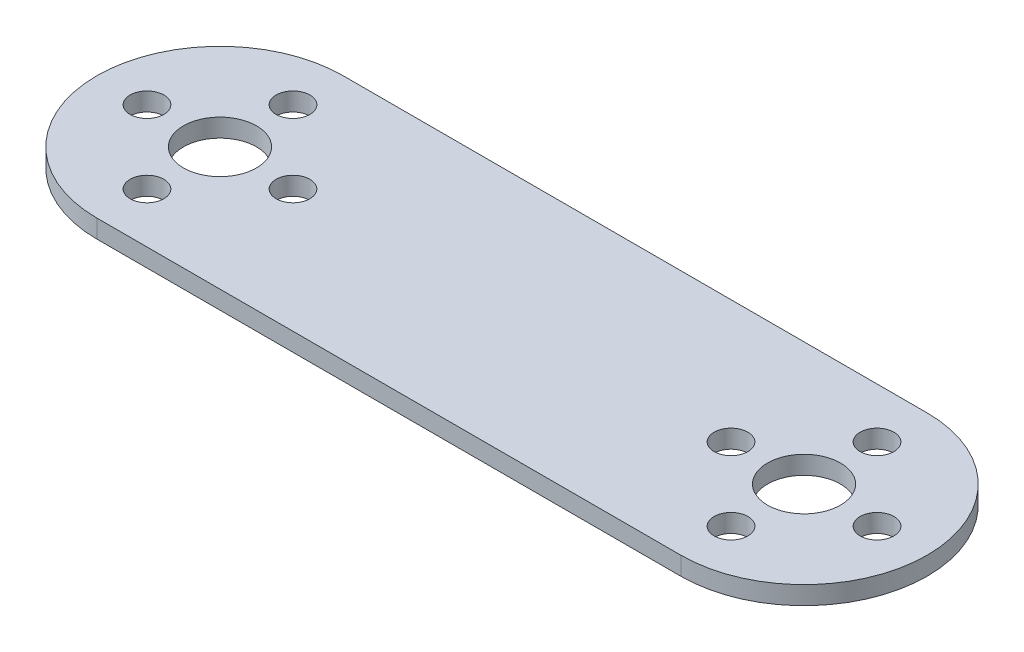
ISO-10303-21;
HEADER;
FILE_DESCRIPTION(('STEP AP214'),'2;1');
FILE_NAME('part.step','',(''),(''),'','','');
FILE_SCHEMA(('AUTOMOTIVE_DESIGN { 1 0 10303 214 1 1 1 1 }'));
ENDSEC;
DATA;
#1=APPLICATION_CONTEXT('core data for automotive mechanical design processes');
#2=APPLICATION_PROTOCOL_DEFINITION('international standard','automotive_design',2000,#1);
#3=PRODUCT_CONTEXT('',#1,'mechanical');
#4=PRODUCT('Part','Part','',(#3));
#5=PRODUCT_RELATED_PRODUCT_CATEGORY('part','',(#4));
#6=PRODUCT_DEFINITION_FORMATION('','',#4);
#7=PRODUCT_DEFINITION_CONTEXT('part definition',#1,'design');
#8=PRODUCT_DEFINITION('design','',#6,#7);
#9=PRODUCT_DEFINITION_SHAPE('','',#8);
#10=(LENGTH_UNIT() NAMED_UNIT(*) SI_UNIT(.MILLI.,.METRE.));
#11=(NAMED_UNIT(*) PLANE_ANGLE_UNIT() SI_UNIT($,.RADIAN.));
#12=(NAMED_UNIT(*) SI_UNIT($,.STERADIAN.) SOLID_ANGLE_UNIT());
#13=UNCERTAINTY_MEASURE_WITH_UNIT(LENGTH_MEASURE(1.E-05),#10,'distance_accuracy_value','');
#14=(GEOMETRIC_REPRESENTATION_CONTEXT(3) GLOBAL_UNCERTAINTY_ASSIGNED_CONTEXT((#13)) GLOBAL_UNIT_ASSIGNED_CONTEXT((#10,
#11,#12)) REPRESENTATION_CONTEXT('',''));
#15=CARTESIAN_POINT('',(0.,0.,0.));
#16=DIRECTION('',(0.,0.,1.));
#17=DIRECTION('',(1.,0.,0.));
#18=AXIS2_PLACEMENT_3D('',#15,#16,#17);
#19=CARTESIAN_POINT('',(0.,2.,0.));
#20=DIRECTION('',(0.,1.,0.));
#21=DIRECTION('',(0.,0.,1.));
#22=AXIS2_PLACEMENT_3D('',#19,#20,#21);
#23=PLANE('',#22);
#24=CARTESIAN_POINT('',(56.,2.,0.));
#25=DIRECTION('',(0.,1.,0.));
#26=DIRECTION('',(0.,0.,1.));
#27=AXIS2_PLACEMENT_3D('',#24,#25,#26);
#28=CIRCLE('',#27,1.85);
#29=CARTESIAN_POINT('',(56.,2.,1.85));
#30=VERTEX_POINT('',#29);
#31=EDGE_CURVE('E112',#30,#30,#28,.F.);
#32=ORIENTED_EDGE('',*,*,#31,.T.);
#33=EDGE_LOOP('',(#32));
#34=FACE_BOUND('',#33,.T.);
#35=CARTESIAN_POINT('',(64.,2.,8.));
#36=DIRECTION('',(0.,1.,0.));
#37=DIRECTION('',(0.,0.,1.));
#38=AXIS2_PLACEMENT_3D('',#35,#36,#37);
#39=CIRCLE('',#38,1.85);
#40=CARTESIAN_POINT('',(64.,2.,9.85));
#41=VERTEX_POINT('',#40);
#42=EDGE_CURVE('E115',#41,#41,#39,.F.);
#43=ORIENTED_EDGE('',*,*,#42,.T.);
#44=EDGE_LOOP('',(#43));
#45=FACE_BOUND('',#44,.T.);
#46=CARTESIAN_POINT('',(72.,2.,0.));
#47=DIRECTION('',(0.,1.,0.));
#48=DIRECTION('',(0.,0.,1.));
#49=AXIS2_PLACEMENT_3D('',#46,#47,#48);
#50=CIRCLE('',#49,1.85);
#51=CARTESIAN_POINT('',(72.,2.,1.85));
#52=VERTEX_POINT('',#51);
#53=EDGE_CURVE('E118',#52,#52,#50,.F.);
#54=ORIENTED_EDGE('',*,*,#53,.T.);
#55=EDGE_LOOP('',(#54));
#56=FACE_BOUND('',#55,.T.);
#57=CARTESIAN_POINT('',(64.,2.,-8.));
#58=DIRECTION('',(0.,1.,0.));
#59=DIRECTION('',(0.,0.,1.));
#60=AXIS2_PLACEMENT_3D('',#57,#58,#59);
#61=CIRCLE('',#60,1.85);
#62=CARTESIAN_POINT('',(64.,2.,-6.15));
#63=VERTEX_POINT('',#62);
#64=EDGE_CURVE('E121',#63,#63,#61,.F.);
#65=ORIENTED_EDGE('',*,*,#64,.T.);
#66=EDGE_LOOP('',(#65));
#67=FACE_BOUND('',#66,.T.);
#68=CARTESIAN_POINT('',(64.,2.,0.));
#69=DIRECTION('',(0.,1.,0.));
#70=DIRECTION('',(0.,0.,1.));
#71=AXIS2_PLACEMENT_3D('',#68,#69,#70);
#72=CIRCLE('',#71,4.);
#73=CARTESIAN_POINT('',(64.,2.,4.));
#74=VERTEX_POINT('',#73);
#75=EDGE_CURVE('E124',#74,#74,#72,.F.);
#76=ORIENTED_EDGE('',*,*,#75,.T.);
#77=EDGE_LOOP('',(#76));
#78=FACE_BOUND('',#77,.T.);
#79=CARTESIAN_POINT('',(-8.,2.,0.));
#80=DIRECTION('',(0.,1.,0.));
#81=DIRECTION('',(0.,0.,1.));
#82=AXIS2_PLACEMENT_3D('',#79,#80,#81);
#83=CIRCLE('',#82,1.85);
#84=CARTESIAN_POINT('',(-8.,2.,1.85));
#85=VERTEX_POINT('',#84);
#86=EDGE_CURVE('E127',#85,#85,#83,.F.);
#87=ORIENTED_EDGE('',*,*,#86,.T.);
#88=EDGE_LOOP('',(#87));
#89=FACE_BOUND('',#88,.T.);
#90=CARTESIAN_POINT('',(0.,2.,8.));
#91=DIRECTION('',(0.,1.,0.));
#92=DIRECTION('',(0.,0.,1.));
#93=AXIS2_PLACEMENT_3D('',#90,#91,#92);
#94=CIRCLE('',#93,1.85);
#95=CARTESIAN_POINT('',(0.,2.,9.85));
#96=VERTEX_POINT('',#95);
#97=EDGE_CURVE('E130',#96,#96,#94,.F.);
#98=ORIENTED_EDGE('',*,*,#97,.T.);
#99=EDGE_LOOP('',(#98));
#100=FACE_BOUND('',#99,.T.);
#101=CARTESIAN_POINT('',(8.,2.,0.));
#102=DIRECTION('',(0.,1.,0.));
#103=DIRECTION('',(0.,0.,1.));
#104=AXIS2_PLACEMENT_3D('',#101,#102,#103);
#105=CIRCLE('',#104,1.85);
#106=CARTESIAN_POINT('',(8.,2.,1.85));
#107=VERTEX_POINT('',#106);
#108=EDGE_CURVE('E133',#107,#107,#105,.F.);
#109=ORIENTED_EDGE('',*,*,#108,.T.);
#110=EDGE_LOOP('',(#109));
#111=FACE_BOUND('',#110,.T.);
#112=CARTESIAN_POINT('',(0.,2.,-8.));
#113=DIRECTION('',(0.,1.,0.));
#114=DIRECTION('',(0.,0.,1.));
#115=AXIS2_PLACEMENT_3D('',#112,#113,#114);
#116=CIRCLE('',#115,1.85);
#117=CARTESIAN_POINT('',(0.,2.,-6.15));
#118=VERTEX_POINT('',#117);
#119=EDGE_CURVE('E136',#118,#118,#116,.F.);
#120=ORIENTED_EDGE('',*,*,#119,.T.);
#121=EDGE_LOOP('',(#120));
#122=FACE_BOUND('',#121,.T.);
#123=CARTESIAN_POINT('',(0.,2.,0.));
#124=DIRECTION('',(0.,1.,0.));
#125=DIRECTION('',(0.,0.,1.));
#126=AXIS2_PLACEMENT_3D('',#123,#124,#125);
#127=CIRCLE('',#126,4.);
#128=CARTESIAN_POINT('',(0.,2.,4.));
#129=VERTEX_POINT('',#128);
#130=EDGE_CURVE('E139',#129,#129,#127,.F.);
#131=ORIENTED_EDGE('',*,*,#130,.T.);
#132=EDGE_LOOP('',(#131));
#133=FACE_BOUND('',#132,.T.);
#134=DIRECTION('',(-1.,0.,0.));
#135=VECTOR('',#134,1.);
#136=CARTESIAN_POINT('',(64.,2.,-13.5));
#137=LINE('',#136,#135);
#138=CARTESIAN_POINT('',(0.,2.,-13.5));
#139=VERTEX_POINT('',#138);
#140=CARTESIAN_POINT('',(64.,2.,-13.5));
#141=VERTEX_POINT('',#140);
#142=EDGE_CURVE('E66',#139,#141,#137,.F.);
#143=ORIENTED_EDGE('',*,*,#142,.F.);
#144=CARTESIAN_POINT('',(0.,2.,0.));
#145=DIRECTION('',(0.,1.,0.));
#146=DIRECTION('',(0.,0.,1.));
#147=AXIS2_PLACEMENT_3D('',#144,#145,#146);
#148=CIRCLE('',#147,13.5);
#149=CARTESIAN_POINT('',(0.,2.,13.5));
#150=VERTEX_POINT('',#149);
#151=EDGE_CURVE('E18',#150,#139,#148,.F.);
#152=ORIENTED_EDGE('',*,*,#151,.F.);
#153=DIRECTION('',(1.,0.,0.));
#154=VECTOR('',#153,1.);
#155=CARTESIAN_POINT('',(0.,2.,13.5));
#156=LINE('',#155,#154);
#157=CARTESIAN_POINT('',(64.,2.,13.5));
#158=VERTEX_POINT('',#157);
#159=EDGE_CURVE('E53',#158,#150,#156,.F.);
#160=ORIENTED_EDGE('',*,*,#159,.F.);
#161=CARTESIAN_POINT('',(64.,2.,0.));
#162=DIRECTION('',(0.,1.,0.));
#163=DIRECTION('',(0.,0.,1.));
#164=AXIS2_PLACEMENT_3D('',#161,#162,#163);
#165=CIRCLE('',#164,13.5);
#166=EDGE_CURVE('E73',#141,#158,#165,.F.);
#167=ORIENTED_EDGE('',*,*,#166,.F.);
#168=EDGE_LOOP('',(#143,#152,#160,#167));
#169=FACE_BOUND('',#168,.T.);
#170=ADVANCED_FACE('F15',(#34,#45,#56,#67,#78,#89,#100,#111,#122,#133,#169),#23,.T.);
#171=CARTESIAN_POINT('',(0.,0.,0.));
#172=DIRECTION('',(0.,1.,0.));
#173=DIRECTION('',(0.,0.,1.));
#174=AXIS2_PLACEMENT_3D('',#171,#172,#173);
#175=CYLINDRICAL_SURFACE('',#174,13.5);
#176=DIRECTION('',(0.,1.,0.));
#177=VECTOR('',#176,1.);
#178=CARTESIAN_POINT('',(0.,0.,-13.5));
#179=LINE('',#178,#177);
#180=CARTESIAN_POINT('',(0.,0.,-13.5));
#181=VERTEX_POINT('',#180);
#182=EDGE_CURVE('E78',#181,#139,#179,.T.);
#183=ORIENTED_EDGE('',*,*,#182,.F.);
#184=CARTESIAN_POINT('',(0.,0.,0.));
#185=DIRECTION('',(0.,1.,0.));
#186=DIRECTION('',(0.,0.,1.));
#187=AXIS2_PLACEMENT_3D('',#184,#185,#186);
#188=CIRCLE('',#187,13.5);
#189=CARTESIAN_POINT('',(0.,0.,13.5));
#190=VERTEX_POINT('',#189);
#191=EDGE_CURVE('E72',#181,#190,#188,.T.);
#192=ORIENTED_EDGE('',*,*,#191,.T.);
#193=DIRECTION('',(0.,1.,0.));
#194=VECTOR('',#193,1.);
#195=CARTESIAN_POINT('',(0.,0.,13.5));
#196=LINE('',#195,#194);
#197=EDGE_CURVE('E58',#150,#190,#196,.F.);
#198=ORIENTED_EDGE('',*,*,#197,.F.);
#199=ORIENTED_EDGE('',*,*,#151,.T.);
#200=EDGE_LOOP('',(#183,#192,#198,#199));
#201=FACE_BOUND('',#200,.T.);
#202=ADVANCED_FACE('F71',(#201),#175,.T.);
#203=CARTESIAN_POINT('',(0.,0.,13.5));
#204=DIRECTION('',(0.,0.,1.));
#205=DIRECTION('',(1.,0.,0.));
#206=AXIS2_PLACEMENT_3D('',#203,#204,#205);
#207=PLANE('',#206);
#208=ORIENTED_EDGE('',*,*,#197,.T.);
#209=DIRECTION('',(1.,0.,0.));
#210=VECTOR('',#209,1.);
#211=CARTESIAN_POINT('',(0.,0.,13.5));
#212=LINE('',#211,#210);
#213=CARTESIAN_POINT('',(64.,0.,13.5));
#214=VERTEX_POINT('',#213);
#215=EDGE_CURVE('E110',#190,#214,#212,.T.);
#216=ORIENTED_EDGE('',*,*,#215,.T.);
#217=DIRECTION('',(0.,1.,0.));
#218=VECTOR('',#217,1.);
#219=CARTESIAN_POINT('',(64.,0.,13.5));
#220=LINE('',#219,#218);
#221=EDGE_CURVE('E60',#158,#214,#220,.F.);
#222=ORIENTED_EDGE('',*,*,#221,.F.);
#223=ORIENTED_EDGE('',*,*,#159,.T.);
#224=EDGE_LOOP('',(#208,#216,#222,#223));
#225=FACE_BOUND('',#224,.T.);
#226=ADVANCED_FACE('F55',(#225),#207,.T.);
#227=CARTESIAN_POINT('',(64.,0.,0.));
#228=DIRECTION('',(0.,1.,0.));
#229=DIRECTION('',(0.,0.,1.));
#230=AXIS2_PLACEMENT_3D('',#227,#228,#229);
#231=CYLINDRICAL_SURFACE('',#230,13.5);
#232=ORIENTED_EDGE('',*,*,#221,.T.);
#233=CARTESIAN_POINT('',(64.,0.,0.));
#234=DIRECTION('',(0.,1.,0.));
#235=DIRECTION('',(0.,0.,1.));
#236=AXIS2_PLACEMENT_3D('',#233,#234,#235);
#237=CIRCLE('',#236,13.5);
#238=CARTESIAN_POINT('',(64.,0.,-13.5));
#239=VERTEX_POINT('',#238);
#240=EDGE_CURVE('E107',#214,#239,#237,.T.);
#241=ORIENTED_EDGE('',*,*,#240,.T.);
#242=DIRECTION('',(0.,1.,0.));
#243=VECTOR('',#242,1.);
#244=CARTESIAN_POINT('',(64.,0.,-13.5));
#245=LINE('',#244,#243);
#246=EDGE_CURVE('E33',#141,#239,#245,.F.);
#247=ORIENTED_EDGE('',*,*,#246,.F.);
#248=ORIENTED_EDGE('',*,*,#166,.T.);
#249=EDGE_LOOP('',(#232,#241,#247,#248));
#250=FACE_BOUND('',#249,.T.);
#251=ADVANCED_FACE('F148',(#250),#231,.T.);
#252=CARTESIAN_POINT('',(64.,0.,-13.5));
#253=DIRECTION('',(0.,0.,-1.));
#254=DIRECTION('',(-1.,0.,0.));
#255=AXIS2_PLACEMENT_3D('',#252,#253,#254);
#256=PLANE('',#255);
#257=ORIENTED_EDGE('',*,*,#246,.T.);
#258=DIRECTION('',(1.,0.,0.));
#259=VECTOR('',#258,1.);
#260=CARTESIAN_POINT('',(0.,0.,-13.5));
#261=LINE('',#260,#259);
#262=EDGE_CURVE('E106',#239,#181,#261,.F.);
#263=ORIENTED_EDGE('',*,*,#262,.T.);
#264=ORIENTED_EDGE('',*,*,#182,.T.);
#265=ORIENTED_EDGE('',*,*,#142,.T.);
#266=EDGE_LOOP('',(#257,#263,#264,#265));
#267=FACE_BOUND('',#266,.T.);
#268=ADVANCED_FACE('F151',(#267),#256,.T.);
#269=CARTESIAN_POINT('',(0.,0.,0.));
#270=DIRECTION('',(0.,1.,0.));
#271=DIRECTION('',(0.,0.,1.));
#272=AXIS2_PLACEMENT_3D('',#269,#270,#271);
#273=CYLINDRICAL_SURFACE('',#272,4.);
#274=CARTESIAN_POINT('',(0.,0.,0.));
#275=DIRECTION('',(0.,1.,0.));
#276=DIRECTION('',(0.,0.,1.));
#277=AXIS2_PLACEMENT_3D('',#274,#275,#276);
#278=CIRCLE('',#277,4.);
#279=CARTESIAN_POINT('',(0.,0.,4.));
#280=VERTEX_POINT('',#279);
#281=EDGE_CURVE('E103',#280,#280,#278,.F.);
#282=ORIENTED_EDGE('',*,*,#281,.T.);
#283=EDGE_LOOP('',(#282));
#284=FACE_BOUND('',#283,.T.);
#285=ORIENTED_EDGE('',*,*,#130,.F.);
#286=EDGE_LOOP('',(#285));
#287=FACE_BOUND('',#286,.T.);
#288=ADVANCED_FACE('F153',(#284,#287),#273,.F.);
#289=CARTESIAN_POINT('',(0.,0.,-8.));
#290=DIRECTION('',(0.,1.,0.));
#291=DIRECTION('',(0.,0.,1.));
#292=AXIS2_PLACEMENT_3D('',#289,#290,#291);
#293=CYLINDRICAL_SURFACE('',#292,1.85);
#294=CARTESIAN_POINT('',(0.,0.,-8.));
#295=DIRECTION('',(0.,1.,0.));
#296=DIRECTION('',(0.,0.,1.));
#297=AXIS2_PLACEMENT_3D('',#294,#295,#296);
#298=CIRCLE('',#297,1.85);
#299=CARTESIAN_POINT('',(0.,0.,-6.15));
#300=VERTEX_POINT('',#299);
#301=EDGE_CURVE('E100',#300,#300,#298,.F.);
#302=ORIENTED_EDGE('',*,*,#301,.T.);
#303=EDGE_LOOP('',(#302));
#304=FACE_BOUND('',#303,.T.);
#305=ORIENTED_EDGE('',*,*,#119,.F.);
#306=EDGE_LOOP('',(#305));
#307=FACE_BOUND('',#306,.T.);
#308=ADVANCED_FACE('F160',(#304,#307),#293,.F.);
#309=CARTESIAN_POINT('',(8.,0.,0.));
#310=DIRECTION('',(0.,1.,0.));
#311=DIRECTION('',(0.,0.,1.));
#312=AXIS2_PLACEMENT_3D('',#309,#310,#311);
#313=CYLINDRICAL_SURFACE('',#312,1.85);
#314=CARTESIAN_POINT('',(8.,0.,0.));
#315=DIRECTION('',(0.,1.,0.));
#316=DIRECTION('',(0.,0.,1.));
#317=AXIS2_PLACEMENT_3D('',#314,#315,#316);
#318=CIRCLE('',#317,1.85);
#319=CARTESIAN_POINT('',(8.,0.,1.85));
#320=VERTEX_POINT('',#319);
#321=EDGE_CURVE('E97',#320,#320,#318,.F.);
#322=ORIENTED_EDGE('',*,*,#321,.T.);
#323=EDGE_LOOP('',(#322));
#324=FACE_BOUND('',#323,.T.);
#325=ORIENTED_EDGE('',*,*,#108,.F.);
#326=EDGE_LOOP('',(#325));
#327=FACE_BOUND('',#326,.T.);
#328=ADVANCED_FACE('F199',(#324,#327),#313,.F.);
#329=CARTESIAN_POINT('',(0.,0.,8.));
#330=DIRECTION('',(0.,1.,0.));
#331=DIRECTION('',(0.,0.,1.));
#332=AXIS2_PLACEMENT_3D('',#329,#330,#331);
#333=CYLINDRICAL_SURFACE('',#332,1.85);
#334=CARTESIAN_POINT('',(0.,0.,8.));
#335=DIRECTION('',(0.,1.,0.));
#336=DIRECTION('',(0.,0.,1.));
#337=AXIS2_PLACEMENT_3D('',#334,#335,#336);
#338=CIRCLE('',#337,1.85);
#339=CARTESIAN_POINT('',(0.,0.,9.85));
#340=VERTEX_POINT('',#339);
#341=EDGE_CURVE('E94',#340,#340,#338,.F.);
#342=ORIENTED_EDGE('',*,*,#341,.T.);
#343=EDGE_LOOP('',(#342));
#344=FACE_BOUND('',#343,.T.);
#345=ORIENTED_EDGE('',*,*,#97,.F.);
#346=EDGE_LOOP('',(#345));
#347=FACE_BOUND('',#346,.T.);
#348=ADVANCED_FACE('F195',(#344,#347),#333,.F.);
#349=CARTESIAN_POINT('',(-8.,0.,0.));
#350=DIRECTION('',(0.,1.,0.));
#351=DIRECTION('',(0.,0.,1.));
#352=AXIS2_PLACEMENT_3D('',#349,#350,#351);
#353=CYLINDRICAL_SURFACE('',#352,1.85);
#354=CARTESIAN_POINT('',(-8.,0.,0.));
#355=DIRECTION('',(0.,1.,0.));
#356=DIRECTION('',(0.,0.,1.));
#357=AXIS2_PLACEMENT_3D('',#354,#355,#356);
#358=CIRCLE('',#357,1.85);
#359=CARTESIAN_POINT('',(-8.,0.,1.85));
#360=VERTEX_POINT('',#359);
#361=EDGE_CURVE('E91',#360,#360,#358,.F.);
#362=ORIENTED_EDGE('',*,*,#361,.T.);
#363=EDGE_LOOP('',(#362));
#364=FACE_BOUND('',#363,.T.);
#365=ORIENTED_EDGE('',*,*,#86,.F.);
#366=EDGE_LOOP('',(#365));
#367=FACE_BOUND('',#366,.T.);
#368=ADVANCED_FACE('F191',(#364,#367),#353,.F.);
#369=CARTESIAN_POINT('',(64.,0.,0.));
#370=DIRECTION('',(0.,1.,0.));
#371=DIRECTION('',(0.,0.,1.));
#372=AXIS2_PLACEMENT_3D('',#369,#370,#371);
#373=CYLINDRICAL_SURFACE('',#372,4.);
#374=ORIENTED_EDGE('',*,*,#75,.F.);
#375=EDGE_LOOP('',(#374));
#376=FACE_BOUND('',#375,.T.);
#377=CARTESIAN_POINT('',(64.,0.,0.));
#378=DIRECTION('',(0.,1.,0.));
#379=DIRECTION('',(0.,0.,1.));
#380=AXIS2_PLACEMENT_3D('',#377,#378,#379);
#381=CIRCLE('',#380,4.);
#382=CARTESIAN_POINT('',(64.,0.,4.));
#383=VERTEX_POINT('',#382);
#384=EDGE_CURVE('E88',#383,#383,#381,.F.);
#385=ORIENTED_EDGE('',*,*,#384,.T.);
#386=EDGE_LOOP('',(#385));
#387=FACE_BOUND('',#386,.T.);
#388=ADVANCED_FACE('F187',(#376,#387),#373,.F.);
#389=CARTESIAN_POINT('',(64.,0.,-8.));
#390=DIRECTION('',(0.,1.,0.));
#391=DIRECTION('',(0.,0.,1.));
#392=AXIS2_PLACEMENT_3D('',#389,#390,#391);
#393=CYLINDRICAL_SURFACE('',#392,1.85);
#394=ORIENTED_EDGE('',*,*,#64,.F.);
#395=EDGE_LOOP('',(#394));
#396=FACE_BOUND('',#395,.T.);
#397=CARTESIAN_POINT('',(64.,0.,-8.));
#398=DIRECTION('',(0.,1.,0.));
#399=DIRECTION('',(0.,0.,1.));
#400=AXIS2_PLACEMENT_3D('',#397,#398,#399);
#401=CIRCLE('',#400,1.85);
#402=CARTESIAN_POINT('',(64.,0.,-6.15));
#403=VERTEX_POINT('',#402);
#404=EDGE_CURVE('E85',#403,#403,#401,.F.);
#405=ORIENTED_EDGE('',*,*,#404,.T.);
#406=EDGE_LOOP('',(#405));
#407=FACE_BOUND('',#406,.T.);
#408=ADVANCED_FACE('F183',(#396,#407),#393,.F.);
#409=CARTESIAN_POINT('',(72.,0.,0.));
#410=DIRECTION('',(0.,1.,0.));
#411=DIRECTION('',(0.,0.,1.));
#412=AXIS2_PLACEMENT_3D('',#409,#410,#411);
#413=CYLINDRICAL_SURFACE('',#412,1.85);
#414=ORIENTED_EDGE('',*,*,#53,.F.);
#415=EDGE_LOOP('',(#414));
#416=FACE_BOUND('',#415,.T.);
#417=CARTESIAN_POINT('',(72.,0.,0.));
#418=DIRECTION('',(0.,1.,0.));
#419=DIRECTION('',(0.,0.,1.));
#420=AXIS2_PLACEMENT_3D('',#417,#418,#419);
#421=CIRCLE('',#420,1.85);
#422=CARTESIAN_POINT('',(72.,0.,1.85));
#423=VERTEX_POINT('',#422);
#424=EDGE_CURVE('E82',#423,#423,#421,.F.);
#425=ORIENTED_EDGE('',*,*,#424,.T.);
#426=EDGE_LOOP('',(#425));
#427=FACE_BOUND('',#426,.T.);
#428=ADVANCED_FACE('F179',(#416,#427),#413,.F.);
#429=CARTESIAN_POINT('',(64.,0.,8.));
#430=DIRECTION('',(0.,1.,0.));
#431=DIRECTION('',(0.,0.,1.));
#432=AXIS2_PLACEMENT_3D('',#429,#430,#431);
#433=CYLINDRICAL_SURFACE('',#432,1.85);
#434=ORIENTED_EDGE('',*,*,#42,.F.);
#435=EDGE_LOOP('',(#434));
#436=FACE_BOUND('',#435,.T.);
#437=CARTESIAN_POINT('',(64.,0.,8.));
#438=DIRECTION('',(0.,1.,0.));
#439=DIRECTION('',(0.,0.,1.));
#440=AXIS2_PLACEMENT_3D('',#437,#438,#439);
#441=CIRCLE('',#440,1.85);
#442=CARTESIAN_POINT('',(64.,0.,9.85));
#443=VERTEX_POINT('',#442);
#444=EDGE_CURVE('E24',#443,#443,#441,.F.);
#445=ORIENTED_EDGE('',*,*,#444,.T.);
#446=EDGE_LOOP('',(#445));
#447=FACE_BOUND('',#446,.T.);
#448=ADVANCED_FACE('F171',(#436,#447),#433,.F.);
#449=CARTESIAN_POINT('',(56.,0.,0.));
#450=DIRECTION('',(0.,1.,0.));
#451=DIRECTION('',(0.,0.,1.));
#452=AXIS2_PLACEMENT_3D('',#449,#450,#451);
#453=CYLINDRICAL_SURFACE('',#452,1.85);
#454=ORIENTED_EDGE('',*,*,#31,.F.);
#455=EDGE_LOOP('',(#454));
#456=FACE_BOUND('',#455,.T.);
#457=CARTESIAN_POINT('',(56.,0.,0.));
#458=DIRECTION('',(0.,1.,0.));
#459=DIRECTION('',(0.,0.,1.));
#460=AXIS2_PLACEMENT_3D('',#457,#458,#459);
#461=CIRCLE('',#460,1.85);
#462=CARTESIAN_POINT('',(56.,0.,1.85));
#463=VERTEX_POINT('',#462);
#464=EDGE_CURVE('E10',#463,#463,#461,.F.);
#465=ORIENTED_EDGE('',*,*,#464,.T.);
#466=EDGE_LOOP('',(#465));
#467=FACE_BOUND('',#466,.T.);
#468=ADVANCED_FACE('F165',(#456,#467),#453,.F.);
#469=CARTESIAN_POINT('',(0.,0.,0.));
#470=DIRECTION('',(0.,1.,0.));
#471=DIRECTION('',(0.,0.,1.));
#472=AXIS2_PLACEMENT_3D('',#469,#470,#471);
#473=PLANE('',#472);
#474=ORIENTED_EDGE('',*,*,#464,.F.);
#475=EDGE_LOOP('',(#474));
#476=FACE_BOUND('',#475,.T.);
#477=ORIENTED_EDGE('',*,*,#444,.F.);
#478=EDGE_LOOP('',(#477));
#479=FACE_BOUND('',#478,.T.);
#480=ORIENTED_EDGE('',*,*,#424,.F.);
#481=EDGE_LOOP('',(#480));
#482=FACE_BOUND('',#481,.T.);
#483=ORIENTED_EDGE('',*,*,#404,.F.);
#484=EDGE_LOOP('',(#483));
#485=FACE_BOUND('',#484,.T.);
#486=ORIENTED_EDGE('',*,*,#384,.F.);
#487=EDGE_LOOP('',(#486));
#488=FACE_BOUND('',#487,.T.);
#489=ORIENTED_EDGE('',*,*,#361,.F.);
#490=EDGE_LOOP('',(#489));
#491=FACE_BOUND('',#490,.T.);
#492=ORIENTED_EDGE('',*,*,#341,.F.);
#493=EDGE_LOOP('',(#492));
#494=FACE_BOUND('',#493,.T.);
#495=ORIENTED_EDGE('',*,*,#321,.F.);
#496=EDGE_LOOP('',(#495));
#497=FACE_BOUND('',#496,.T.);
#498=ORIENTED_EDGE('',*,*,#301,.F.);
#499=EDGE_LOOP('',(#498));
#500=FACE_BOUND('',#499,.T.);
#501=ORIENTED_EDGE('',*,*,#281,.F.);
#502=EDGE_LOOP('',(#501));
#503=FACE_BOUND('',#502,.T.);
#504=ORIENTED_EDGE('',*,*,#240,.F.);
#505=ORIENTED_EDGE('',*,*,#215,.F.);
#506=ORIENTED_EDGE('',*,*,#191,.F.);
#507=ORIENTED_EDGE('',*,*,#262,.F.);
#508=EDGE_LOOP('',(#504,#505,#506,#507));
#509=FACE_BOUND('',#508,.T.);
#510=ADVANCED_FACE('F150',(#476,#479,#482,#485,#488,#491,#494,#497,#500,#503,#509),#473,.F.);
#511=CLOSED_SHELL('',(#170,#202,#226,#251,#268,#288,#308,#328,#348,#368,#388,#408,#428,#448,
#468,#510));
#512=MANIFOLD_SOLID_BREP('B1',#511);
#513=ADVANCED_BREP_SHAPE_REPRESENTATION('',(#18,#512),#14);
#514=SHAPE_DEFINITION_REPRESENTATION(#9,#513);
ENDSEC;
END-ISO-10303-21;
